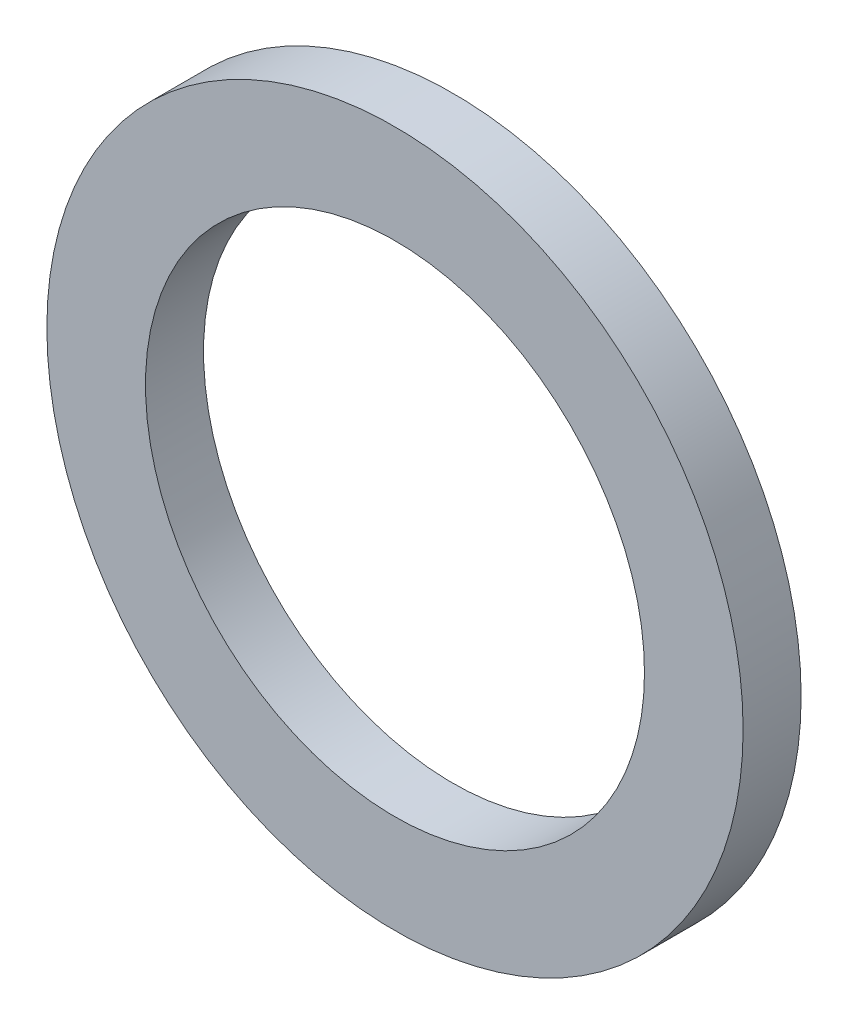
ISO-10303-21;
HEADER;
FILE_DESCRIPTION(('STEP AP214'),'2;1');
FILE_NAME('part.step','',(''),(''),'','','');
FILE_SCHEMA(('AUTOMOTIVE_DESIGN { 1 0 10303 214 1 1 1 1 }'));
ENDSEC;
DATA;
#1=APPLICATION_CONTEXT('core data for automotive mechanical design processes');
#2=APPLICATION_PROTOCOL_DEFINITION('international standard','automotive_design',2000,#1);
#3=PRODUCT_CONTEXT('',#1,'mechanical');
#4=PRODUCT('Part','Part','',(#3));
#5=PRODUCT_RELATED_PRODUCT_CATEGORY('part','',(#4));
#6=PRODUCT_DEFINITION_FORMATION('','',#4);
#7=PRODUCT_DEFINITION_CONTEXT('part definition',#1,'design');
#8=PRODUCT_DEFINITION('design','',#6,#7);
#9=PRODUCT_DEFINITION_SHAPE('','',#8);
#10=(LENGTH_UNIT() NAMED_UNIT(*) SI_UNIT(.MILLI.,.METRE.));
#11=(NAMED_UNIT(*) PLANE_ANGLE_UNIT() SI_UNIT($,.RADIAN.));
#12=(NAMED_UNIT(*) SI_UNIT($,.STERADIAN.) SOLID_ANGLE_UNIT());
#13=UNCERTAINTY_MEASURE_WITH_UNIT(LENGTH_MEASURE(1.E-05),#10,'distance_accuracy_value','');
#14=(GEOMETRIC_REPRESENTATION_CONTEXT(3) GLOBAL_UNCERTAINTY_ASSIGNED_CONTEXT((#13)) GLOBAL_UNIT_ASSIGNED_CONTEXT((#10,
#11,#12)) REPRESENTATION_CONTEXT('',''));
#15=CARTESIAN_POINT('',(0.,0.,0.));
#16=DIRECTION('',(0.,0.,1.));
#17=DIRECTION('',(1.,0.,0.));
#18=AXIS2_PLACEMENT_3D('',#15,#16,#17);
#19=CARTESIAN_POINT('',(0.,0.,0.5));
#20=DIRECTION('',(0.,0.,1.));
#21=DIRECTION('',(1.,0.,0.));
#22=AXIS2_PLACEMENT_3D('',#19,#20,#21);
#23=PLANE('',#22);
#24=CARTESIAN_POINT('',(0.,0.,0.5));
#25=DIRECTION('',(0.,0.,1.));
#26=DIRECTION('',(1.,0.,0.));
#27=AXIS2_PLACEMENT_3D('',#24,#25,#26);
#28=CIRCLE('',#27,3.);
#29=CARTESIAN_POINT('',(3.,0.,0.5));
#30=VERTEX_POINT('',#29);
#31=EDGE_CURVE('E10',#30,#30,#28,.T.);
#32=ORIENTED_EDGE('',*,*,#31,.T.);
#33=EDGE_LOOP('',(#32));
#34=FACE_BOUND('',#33,.T.);
#35=CARTESIAN_POINT('',(0.,0.,0.5));
#36=DIRECTION('',(0.,0.,1.));
#37=DIRECTION('',(1.,0.,0.));
#38=AXIS2_PLACEMENT_3D('',#35,#36,#37);
#39=CIRCLE('',#38,2.15);
#40=CARTESIAN_POINT('',(2.15,0.,0.5));
#41=VERTEX_POINT('',#40);
#42=EDGE_CURVE('E56',#41,#41,#39,.T.);
#43=ORIENTED_EDGE('',*,*,#42,.F.);
#44=EDGE_LOOP('',(#43));
#45=FACE_BOUND('',#44,.T.);
#46=ADVANCED_FACE('F43',(#34,#45),#23,.T.);
#47=CARTESIAN_POINT('',(0.,0.,0.));
#48=DIRECTION('',(0.,0.,1.));
#49=DIRECTION('',(1.,0.,0.));
#50=AXIS2_PLACEMENT_3D('',#47,#48,#49);
#51=PLANE('',#50);
#52=CARTESIAN_POINT('',(0.,0.,0.));
#53=DIRECTION('',(0.,0.,1.));
#54=DIRECTION('',(1.,0.,0.));
#55=AXIS2_PLACEMENT_3D('',#52,#53,#54);
#56=CIRCLE('',#55,3.);
#57=CARTESIAN_POINT('',(3.,0.,0.));
#58=VERTEX_POINT('',#57);
#59=EDGE_CURVE('E47',#58,#58,#56,.T.);
#60=ORIENTED_EDGE('',*,*,#59,.F.);
#61=EDGE_LOOP('',(#60));
#62=FACE_BOUND('',#61,.T.);
#63=CARTESIAN_POINT('',(0.,0.,0.));
#64=DIRECTION('',(0.,0.,1.));
#65=DIRECTION('',(1.,0.,0.));
#66=AXIS2_PLACEMENT_3D('',#63,#64,#65);
#67=CIRCLE('',#66,2.15);
#68=CARTESIAN_POINT('',(2.15,0.,0.));
#69=VERTEX_POINT('',#68);
#70=EDGE_CURVE('E58',#69,#69,#67,.T.);
#71=ORIENTED_EDGE('',*,*,#70,.T.);
#72=EDGE_LOOP('',(#71));
#73=FACE_BOUND('',#72,.T.);
#74=ADVANCED_FACE('F70',(#62,#73),#51,.F.);
#75=CARTESIAN_POINT('',(0.,0.,0.5));
#76=DIRECTION('',(0.,0.,-1.));
#77=DIRECTION('',(-1.,0.,0.));
#78=AXIS2_PLACEMENT_3D('',#75,#76,#77);
#79=CYLINDRICAL_SURFACE('',#78,3.);
#80=ORIENTED_EDGE('',*,*,#31,.F.);
#81=EDGE_LOOP('',(#80));
#82=FACE_BOUND('',#81,.T.);
#83=ORIENTED_EDGE('',*,*,#59,.T.);
#84=EDGE_LOOP('',(#83));
#85=FACE_BOUND('',#84,.T.);
#86=ADVANCED_FACE('F45',(#82,#85),#79,.T.);
#87=CARTESIAN_POINT('',(0.,0.,0.5));
#88=DIRECTION('',(0.,0.,-1.));
#89=DIRECTION('',(-1.,0.,0.));
#90=AXIS2_PLACEMENT_3D('',#87,#88,#89);
#91=CYLINDRICAL_SURFACE('',#90,2.15);
#92=ORIENTED_EDGE('',*,*,#42,.T.);
#93=EDGE_LOOP('',(#92));
#94=FACE_BOUND('',#93,.T.);
#95=ORIENTED_EDGE('',*,*,#70,.F.);
#96=EDGE_LOOP('',(#95));
#97=FACE_BOUND('',#96,.T.);
#98=ADVANCED_FACE('F66',(#94,#97),#91,.F.);
#99=CLOSED_SHELL('',(#46,#74,#86,#98));
#100=MANIFOLD_SOLID_BREP('B2',#99);
#101=ADVANCED_BREP_SHAPE_REPRESENTATION('',(#18,#100),#14);
#102=SHAPE_DEFINITION_REPRESENTATION(#9,#101);
ENDSEC;
END-ISO-10303-21;
